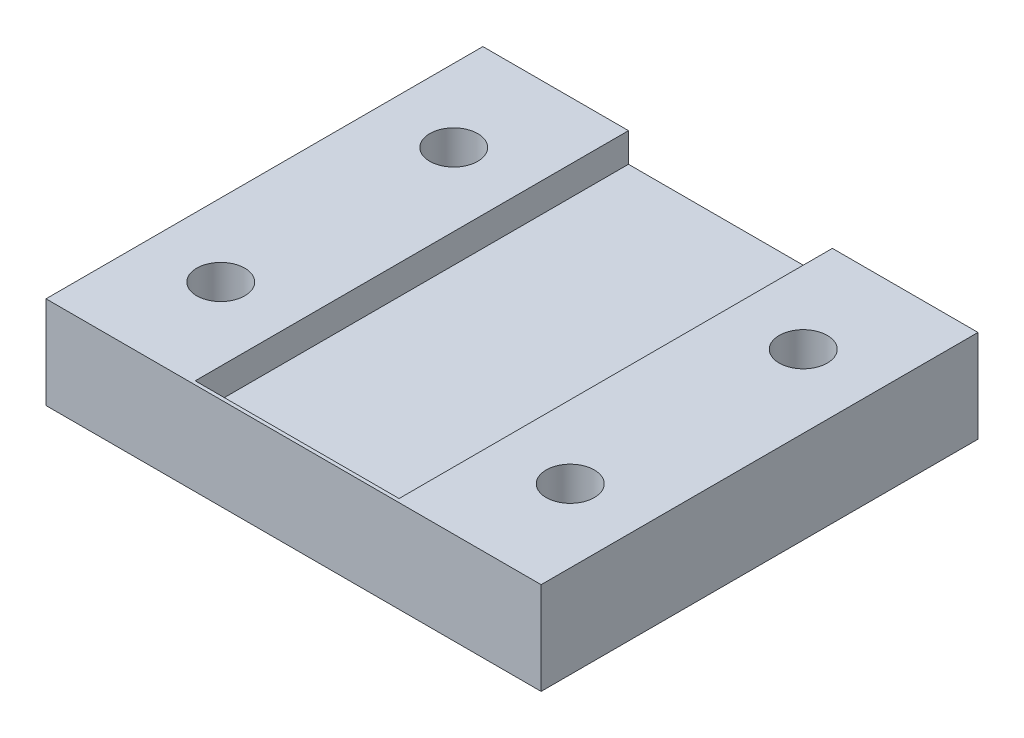
ISO-10303-21;
HEADER;
FILE_DESCRIPTION(('STEP AP214'),'2;1');
FILE_NAME('part.step','',(''),(''),'','','');
FILE_SCHEMA(('AUTOMOTIVE_DESIGN { 1 0 10303 214 1 1 1 1 }'));
ENDSEC;
DATA;
#1=APPLICATION_CONTEXT('core data for automotive mechanical design processes');
#2=APPLICATION_PROTOCOL_DEFINITION('international standard','automotive_design',2000,#1);
#3=PRODUCT_CONTEXT('',#1,'mechanical');
#4=PRODUCT('Part','Part','',(#3));
#5=PRODUCT_RELATED_PRODUCT_CATEGORY('part','',(#4));
#6=PRODUCT_DEFINITION_FORMATION('','',#4);
#7=PRODUCT_DEFINITION_CONTEXT('part definition',#1,'design');
#8=PRODUCT_DEFINITION('design','',#6,#7);
#9=PRODUCT_DEFINITION_SHAPE('','',#8);
#10=(LENGTH_UNIT() NAMED_UNIT(*) SI_UNIT(.MILLI.,.METRE.));
#11=(NAMED_UNIT(*) PLANE_ANGLE_UNIT() SI_UNIT($,.RADIAN.));
#12=(NAMED_UNIT(*) SI_UNIT($,.STERADIAN.) SOLID_ANGLE_UNIT());
#13=UNCERTAINTY_MEASURE_WITH_UNIT(LENGTH_MEASURE(1.E-05),#10,'distance_accuracy_value','');
#14=(GEOMETRIC_REPRESENTATION_CONTEXT(3) GLOBAL_UNCERTAINTY_ASSIGNED_CONTEXT((#13)) GLOBAL_UNIT_ASSIGNED_CONTEXT((#10,
#11,#12)) REPRESENTATION_CONTEXT('',''));
#15=CARTESIAN_POINT('',(0.,0.,0.));
#16=DIRECTION('',(0.,0.,1.));
#17=DIRECTION('',(1.,0.,0.));
#18=AXIS2_PLACEMENT_3D('',#15,#16,#17);
#19=CARTESIAN_POINT('',(-17.,0.,15.));
#20=DIRECTION('',(1.,0.,0.));
#21=DIRECTION('',(0.,0.,-1.));
#22=AXIS2_PLACEMENT_3D('',#19,#20,#21);
#23=PLANE('',#22);
#24=DIRECTION('',(0.,-1.,0.));
#25=VECTOR('',#24,1.);
#26=CARTESIAN_POINT('',(-17.,0.,-15.));
#27=LINE('',#26,#25);
#28=CARTESIAN_POINT('',(-17.,6.35,-15.));
#29=VERTEX_POINT('',#28);
#30=CARTESIAN_POINT('',(-17.,0.,-15.));
#31=VERTEX_POINT('',#30);
#32=EDGE_CURVE('E165',#29,#31,#27,.T.);
#33=ORIENTED_EDGE('',*,*,#32,.T.);
#34=DIRECTION('',(0.,0.,-1.));
#35=VECTOR('',#34,1.);
#36=CARTESIAN_POINT('',(-17.,0.,15.));
#37=LINE('',#36,#35);
#38=CARTESIAN_POINT('',(-17.,0.,15.));
#39=VERTEX_POINT('',#38);
#40=EDGE_CURVE('E11',#39,#31,#37,.T.);
#41=ORIENTED_EDGE('',*,*,#40,.F.);
#42=DIRECTION('',(0.,-1.,0.));
#43=VECTOR('',#42,1.);
#44=CARTESIAN_POINT('',(-17.,0.,15.));
#45=LINE('',#44,#43);
#46=CARTESIAN_POINT('',(-17.,6.35,15.));
#47=VERTEX_POINT('',#46);
#48=EDGE_CURVE('E166',#47,#39,#45,.T.);
#49=ORIENTED_EDGE('',*,*,#48,.F.);
#50=DIRECTION('',(0.,0.,-1.));
#51=VECTOR('',#50,1.);
#52=CARTESIAN_POINT('',(-17.,6.35,15.));
#53=LINE('',#52,#51);
#54=EDGE_CURVE('E173',#47,#29,#53,.T.);
#55=ORIENTED_EDGE('',*,*,#54,.T.);
#56=EDGE_LOOP('',(#33,#41,#49,#55));
#57=FACE_BOUND('',#56,.T.);
#58=ADVANCED_FACE('F34',(#57),#23,.F.);
#59=CARTESIAN_POINT('',(-17.,0.,15.));
#60=DIRECTION('',(0.,1.,0.));
#61=DIRECTION('',(-1.,0.,0.));
#62=AXIS2_PLACEMENT_3D('',#59,#60,#61);
#63=PLANE('',#62);
#64=CARTESIAN_POINT('',(12.,0.,8.));
#65=DIRECTION('',(0.,-1.,0.));
#66=DIRECTION('',(1.,0.,0.));
#67=AXIS2_PLACEMENT_3D('',#64,#65,#66);
#68=CIRCLE('',#67,1.65);
#69=CARTESIAN_POINT('',(13.65,0.,8.));
#70=VERTEX_POINT('',#69);
#71=EDGE_CURVE('E148',#70,#70,#68,.T.);
#72=ORIENTED_EDGE('',*,*,#71,.F.);
#73=EDGE_LOOP('',(#72));
#74=FACE_BOUND('',#73,.T.);
#75=CARTESIAN_POINT('',(-12.,0.,-8.));
#76=DIRECTION('',(0.,-1.,0.));
#77=DIRECTION('',(1.,0.,0.));
#78=AXIS2_PLACEMENT_3D('',#75,#76,#77);
#79=CIRCLE('',#78,1.65);
#80=CARTESIAN_POINT('',(-10.35,0.,-8.));
#81=VERTEX_POINT('',#80);
#82=EDGE_CURVE('E147',#81,#81,#79,.T.);
#83=ORIENTED_EDGE('',*,*,#82,.F.);
#84=EDGE_LOOP('',(#83));
#85=FACE_BOUND('',#84,.T.);
#86=CARTESIAN_POINT('',(12.,0.,-8.));
#87=DIRECTION('',(0.,-1.,0.));
#88=DIRECTION('',(1.,0.,0.));
#89=AXIS2_PLACEMENT_3D('',#86,#87,#88);
#90=CIRCLE('',#89,1.65);
#91=CARTESIAN_POINT('',(13.65,0.,-8.));
#92=VERTEX_POINT('',#91);
#93=EDGE_CURVE('E137',#92,#92,#90,.T.);
#94=ORIENTED_EDGE('',*,*,#93,.F.);
#95=EDGE_LOOP('',(#94));
#96=FACE_BOUND('',#95,.T.);
#97=CARTESIAN_POINT('',(-12.,0.,8.));
#98=DIRECTION('',(0.,-1.,0.));
#99=DIRECTION('',(1.,0.,0.));
#100=AXIS2_PLACEMENT_3D('',#97,#98,#99);
#101=CIRCLE('',#100,1.65);
#102=CARTESIAN_POINT('',(-10.35,0.,8.));
#103=VERTEX_POINT('',#102);
#104=EDGE_CURVE('E155',#103,#103,#101,.T.);
#105=ORIENTED_EDGE('',*,*,#104,.F.);
#106=EDGE_LOOP('',(#105));
#107=FACE_BOUND('',#106,.T.);
#108=DIRECTION('',(1.,0.,0.));
#109=VECTOR('',#108,1.);
#110=CARTESIAN_POINT('',(-17.,0.,-15.));
#111=LINE('',#110,#109);
#112=CARTESIAN_POINT('',(17.,0.,-15.));
#113=VERTEX_POINT('',#112);
#114=EDGE_CURVE('E176',#31,#113,#111,.T.);
#115=ORIENTED_EDGE('',*,*,#114,.T.);
#116=DIRECTION('',(0.,0.,-1.));
#117=VECTOR('',#116,1.);
#118=CARTESIAN_POINT('',(17.,0.,15.));
#119=LINE('',#118,#117);
#120=CARTESIAN_POINT('',(17.,0.,15.));
#121=VERTEX_POINT('',#120);
#122=EDGE_CURVE('E41',#121,#113,#119,.T.);
#123=ORIENTED_EDGE('',*,*,#122,.F.);
#124=DIRECTION('',(1.,0.,0.));
#125=VECTOR('',#124,1.);
#126=CARTESIAN_POINT('',(-17.,0.,15.));
#127=LINE('',#126,#125);
#128=EDGE_CURVE('E85',#39,#121,#127,.T.);
#129=ORIENTED_EDGE('',*,*,#128,.F.);
#130=ORIENTED_EDGE('',*,*,#40,.T.);
#131=EDGE_LOOP('',(#115,#123,#129,#130));
#132=FACE_BOUND('',#131,.T.);
#133=ADVANCED_FACE('F213',(#74,#85,#96,#107,#132),#63,.F.);
#134=CARTESIAN_POINT('',(17.,0.,15.));
#135=DIRECTION('',(-1.,0.,0.));
#136=DIRECTION('',(0.,0.,1.));
#137=AXIS2_PLACEMENT_3D('',#134,#135,#136);
#138=PLANE('',#137);
#139=DIRECTION('',(0.,1.,0.));
#140=VECTOR('',#139,1.);
#141=CARTESIAN_POINT('',(17.,0.,-15.));
#142=LINE('',#141,#140);
#143=CARTESIAN_POINT('',(17.,6.35,-15.));
#144=VERTEX_POINT('',#143);
#145=EDGE_CURVE('E178',#113,#144,#142,.T.);
#146=ORIENTED_EDGE('',*,*,#145,.T.);
#147=DIRECTION('',(0.,0.,-1.));
#148=VECTOR('',#147,1.);
#149=CARTESIAN_POINT('',(17.,6.35,15.));
#150=LINE('',#149,#148);
#151=CARTESIAN_POINT('',(17.,6.35,15.));
#152=VERTEX_POINT('',#151);
#153=EDGE_CURVE('E183',#152,#144,#150,.T.);
#154=ORIENTED_EDGE('',*,*,#153,.F.);
#155=DIRECTION('',(0.,1.,0.));
#156=VECTOR('',#155,1.);
#157=CARTESIAN_POINT('',(17.,0.,15.));
#158=LINE('',#157,#156);
#159=EDGE_CURVE('E170',#121,#152,#158,.T.);
#160=ORIENTED_EDGE('',*,*,#159,.F.);
#161=ORIENTED_EDGE('',*,*,#122,.T.);
#162=EDGE_LOOP('',(#146,#154,#160,#161));
#163=FACE_BOUND('',#162,.T.);
#164=ADVANCED_FACE('F189',(#163),#138,.F.);
#165=CARTESIAN_POINT('',(-17.,6.35,15.));
#166=DIRECTION('',(0.,-1.,0.));
#167=DIRECTION('',(1.,0.,0.));
#168=AXIS2_PLACEMENT_3D('',#165,#166,#167);
#169=PLANE('',#168);
#170=CARTESIAN_POINT('',(12.,6.35,8.));
#171=DIRECTION('',(0.,-1.,0.));
#172=DIRECTION('',(1.,0.,0.));
#173=AXIS2_PLACEMENT_3D('',#170,#171,#172);
#174=CIRCLE('',#173,1.65);
#175=CARTESIAN_POINT('',(13.65,6.35,8.));
#176=VERTEX_POINT('',#175);
#177=EDGE_CURVE('E151',#176,#176,#174,.F.);
#178=ORIENTED_EDGE('',*,*,#177,.F.);
#179=EDGE_LOOP('',(#178));
#180=FACE_BOUND('',#179,.T.);
#181=CARTESIAN_POINT('',(-12.,6.35,-8.));
#182=DIRECTION('',(0.,-1.,0.));
#183=DIRECTION('',(1.,0.,0.));
#184=AXIS2_PLACEMENT_3D('',#181,#182,#183);
#185=CIRCLE('',#184,1.65);
#186=CARTESIAN_POINT('',(-10.35,6.35,-8.));
#187=VERTEX_POINT('',#186);
#188=EDGE_CURVE('E152',#187,#187,#185,.F.);
#189=ORIENTED_EDGE('',*,*,#188,.F.);
#190=EDGE_LOOP('',(#189));
#191=FACE_BOUND('',#190,.T.);
#192=CARTESIAN_POINT('',(12.,6.35,-8.));
#193=DIRECTION('',(0.,-1.,0.));
#194=DIRECTION('',(1.,0.,0.));
#195=AXIS2_PLACEMENT_3D('',#192,#193,#194);
#196=CIRCLE('',#195,1.65);
#197=CARTESIAN_POINT('',(13.65,6.35,-8.));
#198=VERTEX_POINT('',#197);
#199=EDGE_CURVE('E144',#198,#198,#196,.F.);
#200=ORIENTED_EDGE('',*,*,#199,.F.);
#201=EDGE_LOOP('',(#200));
#202=FACE_BOUND('',#201,.T.);
#203=CARTESIAN_POINT('',(-12.,6.35,8.));
#204=DIRECTION('',(0.,-1.,0.));
#205=DIRECTION('',(1.,0.,0.));
#206=AXIS2_PLACEMENT_3D('',#203,#204,#205);
#207=CIRCLE('',#206,1.65);
#208=CARTESIAN_POINT('',(-10.35,6.35,8.));
#209=VERTEX_POINT('',#208);
#210=EDGE_CURVE('E162',#209,#209,#207,.F.);
#211=ORIENTED_EDGE('',*,*,#210,.F.);
#212=EDGE_LOOP('',(#211));
#213=FACE_BOUND('',#212,.T.);
#214=DIRECTION('',(1.,0.,0.));
#215=VECTOR('',#214,1.);
#216=CARTESIAN_POINT('',(-7.,6.35,14.7549669518412));
#217=LINE('',#216,#215);
#218=CARTESIAN_POINT('',(-7.,6.35,14.7549669518412));
#219=VERTEX_POINT('',#218);
#220=CARTESIAN_POINT('',(7.,6.35,14.7549669518412));
#221=VERTEX_POINT('',#220);
#222=EDGE_CURVE('E128',#219,#221,#217,.T.);
#223=ORIENTED_EDGE('',*,*,#222,.F.);
#224=DIRECTION('',(0.,0.,1.));
#225=VECTOR('',#224,1.);
#226=CARTESIAN_POINT('',(-7.,6.35,14.7549669518412));
#227=LINE('',#226,#225);
#228=CARTESIAN_POINT('',(-7.,6.35,-15.));
#229=VERTEX_POINT('',#228);
#230=EDGE_CURVE('E113',#229,#219,#227,.T.);
#231=ORIENTED_EDGE('',*,*,#230,.F.);
#232=DIRECTION('',(-1.,0.,0.));
#233=VECTOR('',#232,1.);
#234=CARTESIAN_POINT('',(-17.,6.35,-15.));
#235=LINE('',#234,#233);
#236=EDGE_CURVE('E78',#229,#29,#235,.T.);
#237=ORIENTED_EDGE('',*,*,#236,.T.);
#238=ORIENTED_EDGE('',*,*,#54,.F.);
#239=DIRECTION('',(-1.,0.,0.));
#240=VECTOR('',#239,1.);
#241=CARTESIAN_POINT('',(-17.,6.35,15.));
#242=LINE('',#241,#240);
#243=EDGE_CURVE('E57',#152,#47,#242,.T.);
#244=ORIENTED_EDGE('',*,*,#243,.F.);
#245=ORIENTED_EDGE('',*,*,#153,.T.);
#246=CARTESIAN_POINT('',(7.,6.35,-15.));
#247=VERTEX_POINT('',#246);
#248=EDGE_CURVE('E168',#144,#247,#235,.T.);
#249=ORIENTED_EDGE('',*,*,#248,.T.);
#250=DIRECTION('',(0.,0.,-1.));
#251=VECTOR('',#250,1.);
#252=CARTESIAN_POINT('',(7.,6.35,14.7549669518412));
#253=LINE('',#252,#251);
#254=EDGE_CURVE('E126',#221,#247,#253,.T.);
#255=ORIENTED_EDGE('',*,*,#254,.F.);
#256=EDGE_LOOP('',(#223,#231,#237,#238,#244,#245,#249,#255));
#257=FACE_BOUND('',#256,.T.);
#258=ADVANCED_FACE('F196',(#180,#191,#202,#213,#257),#169,.F.);
#259=CARTESIAN_POINT('',(0.,0.,15.));
#260=DIRECTION('',(0.,0.,-1.));
#261=DIRECTION('',(-1.,0.,0.));
#262=AXIS2_PLACEMENT_3D('',#259,#260,#261);
#263=PLANE('',#262);
#264=ORIENTED_EDGE('',*,*,#48,.T.);
#265=ORIENTED_EDGE('',*,*,#128,.T.);
#266=ORIENTED_EDGE('',*,*,#159,.T.);
#267=ORIENTED_EDGE('',*,*,#243,.T.);
#268=EDGE_LOOP('',(#264,#265,#266,#267));
#269=FACE_BOUND('',#268,.T.);
#270=ADVANCED_FACE('F200',(#269),#263,.F.);
#271=CARTESIAN_POINT('',(0.,0.,-15.));
#272=DIRECTION('',(0.,0.,-1.));
#273=DIRECTION('',(-1.,0.,0.));
#274=AXIS2_PLACEMENT_3D('',#271,#272,#273);
#275=PLANE('',#274);
#276=DIRECTION('',(0.,1.,0.));
#277=VECTOR('',#276,1.);
#278=CARTESIAN_POINT('',(-7.,4.35,-15.));
#279=LINE('',#278,#277);
#280=CARTESIAN_POINT('',(-7.,4.35,-15.));
#281=VERTEX_POINT('',#280);
#282=EDGE_CURVE('E135',#281,#229,#279,.T.);
#283=ORIENTED_EDGE('',*,*,#282,.F.);
#284=DIRECTION('',(-1.,0.,0.));
#285=VECTOR('',#284,1.);
#286=CARTESIAN_POINT('',(-7.,4.35,-15.));
#287=LINE('',#286,#285);
#288=CARTESIAN_POINT('',(7.,4.35,-15.));
#289=VERTEX_POINT('',#288);
#290=EDGE_CURVE('E118',#289,#281,#287,.T.);
#291=ORIENTED_EDGE('',*,*,#290,.F.);
#292=DIRECTION('',(0.,1.,0.));
#293=VECTOR('',#292,1.);
#294=CARTESIAN_POINT('',(7.,4.35,-15.));
#295=LINE('',#294,#293);
#296=EDGE_CURVE('E138',#289,#247,#295,.T.);
#297=ORIENTED_EDGE('',*,*,#296,.T.);
#298=ORIENTED_EDGE('',*,*,#248,.F.);
#299=ORIENTED_EDGE('',*,*,#145,.F.);
#300=ORIENTED_EDGE('',*,*,#114,.F.);
#301=ORIENTED_EDGE('',*,*,#32,.F.);
#302=ORIENTED_EDGE('',*,*,#236,.F.);
#303=EDGE_LOOP('',(#283,#291,#297,#298,#299,#300,#301,#302));
#304=FACE_BOUND('',#303,.T.);
#305=ADVANCED_FACE('F193',(#304),#275,.T.);
#306=CARTESIAN_POINT('',(-12.,11.0169047558312,8.));
#307=DIRECTION('',(0.,-1.,0.));
#308=DIRECTION('',(1.,0.,0.));
#309=AXIS2_PLACEMENT_3D('',#306,#307,#308);
#310=CYLINDRICAL_SURFACE('',#309,1.65);
#311=ORIENTED_EDGE('',*,*,#210,.T.);
#312=EDGE_LOOP('',(#311));
#313=FACE_BOUND('',#312,.T.);
#314=ORIENTED_EDGE('',*,*,#104,.T.);
#315=EDGE_LOOP('',(#314));
#316=FACE_BOUND('',#315,.T.);
#317=ADVANCED_FACE('F207',(#313,#316),#310,.F.);
#318=CARTESIAN_POINT('',(12.,11.0169047558312,-8.));
#319=DIRECTION('',(0.,-1.,0.));
#320=DIRECTION('',(1.,0.,0.));
#321=AXIS2_PLACEMENT_3D('',#318,#319,#320);
#322=CYLINDRICAL_SURFACE('',#321,1.65);
#323=ORIENTED_EDGE('',*,*,#199,.T.);
#324=EDGE_LOOP('',(#323));
#325=FACE_BOUND('',#324,.T.);
#326=ORIENTED_EDGE('',*,*,#93,.T.);
#327=EDGE_LOOP('',(#326));
#328=FACE_BOUND('',#327,.T.);
#329=ADVANCED_FACE('F231',(#325,#328),#322,.F.);
#330=CARTESIAN_POINT('',(-12.,11.0169047558312,-8.));
#331=DIRECTION('',(0.,-1.,0.));
#332=DIRECTION('',(1.,0.,0.));
#333=AXIS2_PLACEMENT_3D('',#330,#331,#332);
#334=CYLINDRICAL_SURFACE('',#333,1.65);
#335=ORIENTED_EDGE('',*,*,#188,.T.);
#336=EDGE_LOOP('',(#335));
#337=FACE_BOUND('',#336,.T.);
#338=ORIENTED_EDGE('',*,*,#82,.T.);
#339=EDGE_LOOP('',(#338));
#340=FACE_BOUND('',#339,.T.);
#341=ADVANCED_FACE('F236',(#337,#340),#334,.F.);
#342=CARTESIAN_POINT('',(12.,11.0169047558312,8.));
#343=DIRECTION('',(0.,-1.,0.));
#344=DIRECTION('',(1.,0.,0.));
#345=AXIS2_PLACEMENT_3D('',#342,#343,#344);
#346=CYLINDRICAL_SURFACE('',#345,1.65);
#347=ORIENTED_EDGE('',*,*,#177,.T.);
#348=EDGE_LOOP('',(#347));
#349=FACE_BOUND('',#348,.T.);
#350=ORIENTED_EDGE('',*,*,#71,.T.);
#351=EDGE_LOOP('',(#350));
#352=FACE_BOUND('',#351,.T.);
#353=ADVANCED_FACE('F242',(#349,#352),#346,.F.);
#354=CARTESIAN_POINT('',(-7.,4.35,14.7549669518412));
#355=DIRECTION('',(-1.,0.,0.));
#356=DIRECTION('',(0.,-1.,0.));
#357=AXIS2_PLACEMENT_3D('',#354,#355,#356);
#358=PLANE('',#357);
#359=ORIENTED_EDGE('',*,*,#230,.T.);
#360=DIRECTION('',(0.,1.,0.));
#361=VECTOR('',#360,1.);
#362=CARTESIAN_POINT('',(-7.,4.35,14.7549669518412));
#363=LINE('',#362,#361);
#364=CARTESIAN_POINT('',(-7.,4.35,14.7549669518412));
#365=VERTEX_POINT('',#364);
#366=EDGE_CURVE('E108',#365,#219,#363,.T.);
#367=ORIENTED_EDGE('',*,*,#366,.F.);
#368=DIRECTION('',(0.,0.,1.));
#369=VECTOR('',#368,1.);
#370=CARTESIAN_POINT('',(-7.,4.35,14.7549669518412));
#371=LINE('',#370,#369);
#372=EDGE_CURVE('E112',#281,#365,#371,.T.);
#373=ORIENTED_EDGE('',*,*,#372,.F.);
#374=ORIENTED_EDGE('',*,*,#282,.T.);
#375=EDGE_LOOP('',(#359,#367,#373,#374));
#376=FACE_BOUND('',#375,.T.);
#377=ADVANCED_FACE('F110',(#376),#358,.F.);
#378=CARTESIAN_POINT('',(7.,4.35,14.7549669518412));
#379=DIRECTION('',(1.,0.,0.));
#380=DIRECTION('',(0.,1.,0.));
#381=AXIS2_PLACEMENT_3D('',#378,#379,#380);
#382=PLANE('',#381);
#383=ORIENTED_EDGE('',*,*,#254,.T.);
#384=ORIENTED_EDGE('',*,*,#296,.F.);
#385=DIRECTION('',(0.,0.,-1.));
#386=VECTOR('',#385,1.);
#387=CARTESIAN_POINT('',(7.,4.35,14.7549669518412));
#388=LINE('',#387,#386);
#389=CARTESIAN_POINT('',(7.,4.35,14.7549669518412));
#390=VERTEX_POINT('',#389);
#391=EDGE_CURVE('E48',#390,#289,#388,.T.);
#392=ORIENTED_EDGE('',*,*,#391,.F.);
#393=DIRECTION('',(0.,1.,0.));
#394=VECTOR('',#393,1.);
#395=CARTESIAN_POINT('',(7.,4.35,14.7549669518412));
#396=LINE('',#395,#394);
#397=EDGE_CURVE('E117',#390,#221,#396,.T.);
#398=ORIENTED_EDGE('',*,*,#397,.T.);
#399=EDGE_LOOP('',(#383,#384,#392,#398));
#400=FACE_BOUND('',#399,.T.);
#401=ADVANCED_FACE('F249',(#400),#382,.F.);
#402=CARTESIAN_POINT('',(-7.,4.35,14.7549669518412));
#403=DIRECTION('',(0.,0.,1.));
#404=DIRECTION('',(1.,0.,0.));
#405=AXIS2_PLACEMENT_3D('',#402,#403,#404);
#406=PLANE('',#405);
#407=ORIENTED_EDGE('',*,*,#222,.T.);
#408=ORIENTED_EDGE('',*,*,#397,.F.);
#409=DIRECTION('',(1.,0.,0.));
#410=VECTOR('',#409,1.);
#411=CARTESIAN_POINT('',(-7.,4.35,14.7549669518412));
#412=LINE('',#411,#410);
#413=EDGE_CURVE('E120',#365,#390,#412,.T.);
#414=ORIENTED_EDGE('',*,*,#413,.F.);
#415=ORIENTED_EDGE('',*,*,#366,.T.);
#416=EDGE_LOOP('',(#407,#408,#414,#415));
#417=FACE_BOUND('',#416,.T.);
#418=ADVANCED_FACE('F121',(#417),#406,.F.);
#419=CARTESIAN_POINT('',(0.,4.35,0.));
#420=DIRECTION('',(0.,-1.,0.));
#421=DIRECTION('',(1.,0.,0.));
#422=AXIS2_PLACEMENT_3D('',#419,#420,#421);
#423=PLANE('',#422);
#424=ORIENTED_EDGE('',*,*,#372,.T.);
#425=ORIENTED_EDGE('',*,*,#413,.T.);
#426=ORIENTED_EDGE('',*,*,#391,.T.);
#427=ORIENTED_EDGE('',*,*,#290,.T.);
#428=EDGE_LOOP('',(#424,#425,#426,#427));
#429=FACE_BOUND('',#428,.T.);
#430=ADVANCED_FACE('F123',(#429),#423,.F.);
#431=CLOSED_SHELL('',(#58,#133,#164,#258,#270,#305,#317,#329,#341,#353,#377,#401,#418,#430));
#432=MANIFOLD_SOLID_BREP('B2',#431);
#433=ADVANCED_BREP_SHAPE_REPRESENTATION('',(#18,#432),#14);
#434=SHAPE_DEFINITION_REPRESENTATION(#9,#433);
ENDSEC;
END-ISO-10303-21;
